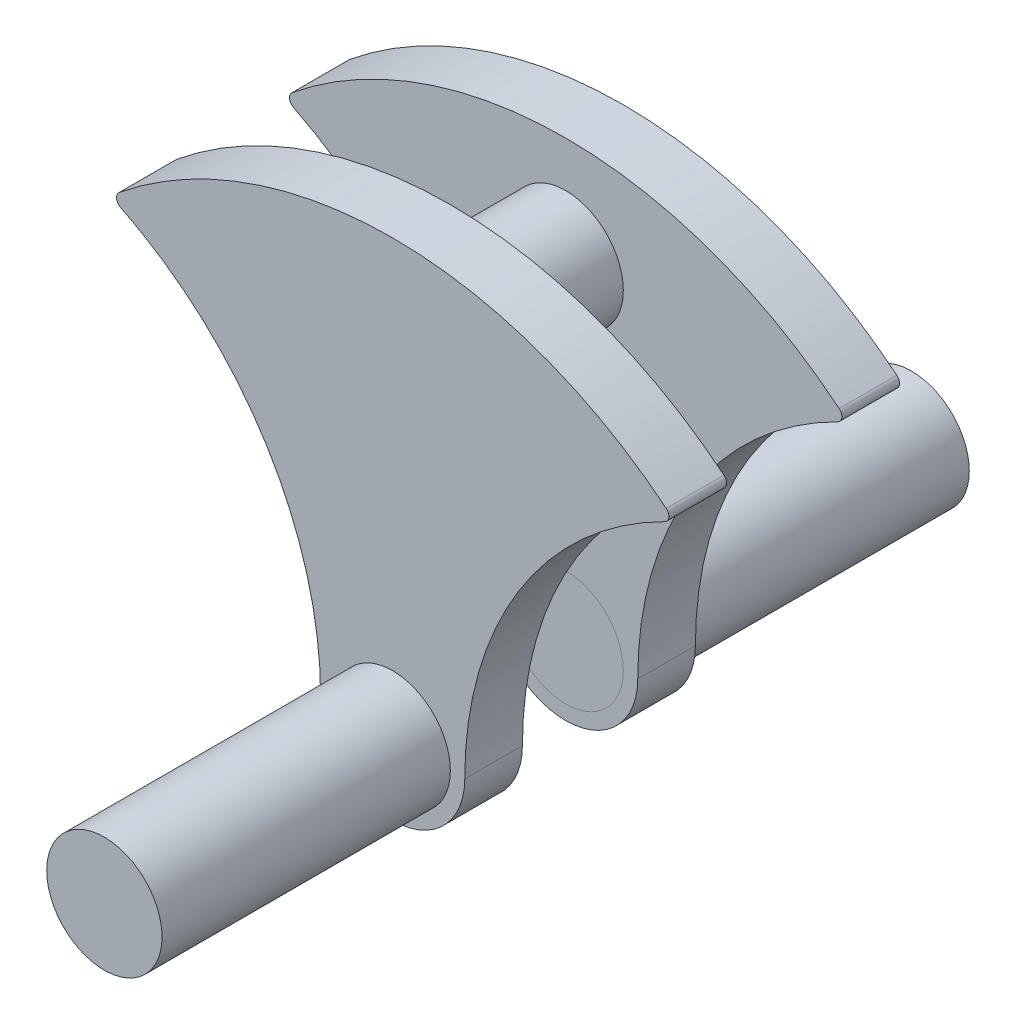
ISO-10303-21;
HEADER;
FILE_DESCRIPTION(('STEP AP214'),'2;1');
FILE_NAME('part.step','',(''),(''),'','','');
FILE_SCHEMA(('AUTOMOTIVE_DESIGN { 1 0 10303 214 1 1 1 1 }'));
ENDSEC;
DATA;
#1=APPLICATION_CONTEXT('core data for automotive mechanical design processes');
#2=APPLICATION_PROTOCOL_DEFINITION('international standard','automotive_design',2000,#1);
#3=PRODUCT_CONTEXT('',#1,'mechanical');
#4=PRODUCT('Part','Part','',(#3));
#5=PRODUCT_RELATED_PRODUCT_CATEGORY('part','',(#4));
#6=PRODUCT_DEFINITION_FORMATION('','',#4);
#7=PRODUCT_DEFINITION_CONTEXT('part definition',#1,'design');
#8=PRODUCT_DEFINITION('design','',#6,#7);
#9=PRODUCT_DEFINITION_SHAPE('','',#8);
#10=(LENGTH_UNIT() NAMED_UNIT(*) SI_UNIT(.MILLI.,.METRE.));
#11=(NAMED_UNIT(*) PLANE_ANGLE_UNIT() SI_UNIT($,.RADIAN.));
#12=(NAMED_UNIT(*) SI_UNIT($,.STERADIAN.) SOLID_ANGLE_UNIT());
#13=UNCERTAINTY_MEASURE_WITH_UNIT(LENGTH_MEASURE(1.E-05),#10,'distance_accuracy_value','');
#14=(GEOMETRIC_REPRESENTATION_CONTEXT(3) GLOBAL_UNCERTAINTY_ASSIGNED_CONTEXT((#13)) GLOBAL_UNIT_ASSIGNED_CONTEXT((#10,
#11,#12)) REPRESENTATION_CONTEXT('',''));
#15=CARTESIAN_POINT('',(0.,0.,0.));
#16=DIRECTION('',(0.,0.,1.));
#17=DIRECTION('',(1.,0.,0.));
#18=AXIS2_PLACEMENT_3D('',#15,#16,#17);
#19=CARTESIAN_POINT('',(0.,0.,20.));
#20=DIRECTION('',(0.,0.,-1.));
#21=DIRECTION('',(-1.,0.,0.));
#22=AXIS2_PLACEMENT_3D('',#19,#20,#21);
#23=CYLINDRICAL_SURFACE('',#22,20.);
#24=CARTESIAN_POINT('',(0.,0.,20.));
#25=DIRECTION('',(0.,0.,1.));
#26=DIRECTION('',(1.,0.,0.));
#27=AXIS2_PLACEMENT_3D('',#24,#25,#26);
#28=CIRCLE('',#27,20.);
#29=CARTESIAN_POINT('',(20.,0.,20.));
#30=VERTEX_POINT('',#29);
#31=EDGE_CURVE('E11',#30,#30,#28,.T.);
#32=ORIENTED_EDGE('',*,*,#31,.F.);
#33=EDGE_LOOP('',(#32));
#34=FACE_BOUND('',#33,.T.);
#35=CARTESIAN_POINT('',(0.,0.,-100.));
#36=DIRECTION('',(0.,0.,1.));
#37=DIRECTION('',(1.,0.,0.));
#38=AXIS2_PLACEMENT_3D('',#35,#36,#37);
#39=CIRCLE('',#38,20.);
#40=CARTESIAN_POINT('',(20.,0.,-100.));
#41=VERTEX_POINT('',#40);
#42=EDGE_CURVE('E55',#41,#41,#39,.T.);
#43=ORIENTED_EDGE('',*,*,#42,.T.);
#44=EDGE_LOOP('',(#43));
#45=FACE_BOUND('',#44,.T.);
#46=ADVANCED_FACE('F49',(#34,#45),#23,.T.);
#47=CARTESIAN_POINT('',(0.,0.,20.));
#48=DIRECTION('',(0.,0.,1.));
#49=DIRECTION('',(1.,0.,0.));
#50=AXIS2_PLACEMENT_3D('',#47,#48,#49);
#51=PLANE('',#50);
#52=ORIENTED_EDGE('',*,*,#31,.T.);
#53=EDGE_LOOP('',(#52));
#54=FACE_BOUND('',#53,.T.);
#55=ADVANCED_FACE('F64',(#54),#51,.T.);
#56=CARTESIAN_POINT('',(0.,0.,-100.));
#57=DIRECTION('',(0.,0.,1.));
#58=DIRECTION('',(1.,0.,0.));
#59=AXIS2_PLACEMENT_3D('',#56,#57,#58);
#60=PLANE('',#59);
#61=ORIENTED_EDGE('',*,*,#42,.F.);
#62=EDGE_LOOP('',(#61));
#63=FACE_BOUND('',#62,.T.);
#64=ADVANCED_FACE('F62',(#63),#60,.F.);
#65=CLOSED_SHELL('',(#46,#55,#64));
#66=MANIFOLD_SOLID_BREP('B2',#65);
#67=CARTESIAN_POINT('',(75.,0.,20.));
#68=DIRECTION('',(0.,0.,1.));
#69=DIRECTION('',(1.,0.,0.));
#70=AXIS2_PLACEMENT_3D('',#67,#68,#69);
#71=PLANE('',#70);
#72=CARTESIAN_POINT('',(0.,0.,20.));
#73=DIRECTION('',(0.,0.,1.));
#74=DIRECTION('',(1.,0.,0.));
#75=AXIS2_PLACEMENT_3D('',#72,#73,#74);
#76=CIRCLE('',#75,20.);
#77=CARTESIAN_POINT('',(20.,0.,20.));
#78=VERTEX_POINT('',#77);
#79=EDGE_CURVE('E191',#78,#78,#76,.T.);
#80=ORIENTED_EDGE('',*,*,#79,.F.);
#81=EDGE_LOOP('',(#80));
#82=FACE_BOUND('',#81,.T.);
#83=CARTESIAN_POINT('',(150.,0.,20.));
#84=DIRECTION('',(0.,0.,-1.));
#85=DIRECTION('',(1.,0.,0.));
#86=AXIS2_PLACEMENT_3D('',#83,#84,#85);
#87=CIRCLE('',#86,125.);
#88=CARTESIAN_POINT('',(25.,0.,20.));
#89=VERTEX_POINT('',#88);
#90=CARTESIAN_POINT('',(94.3899952955936,111.948771216016,20.));
#91=VERTEX_POINT('',#90);
#92=EDGE_CURVE('E198',#89,#91,#87,.T.);
#93=ORIENTED_EDGE('',*,*,#92,.T.);
#94=CARTESIAN_POINT('',(93.26,114.223570247125,20.));
#95=DIRECTION('',(0.,0.,1.));
#96=DIRECTION('',(1.,0.,0.));
#97=AXIS2_PLACEMENT_3D('',#94,#95,#96);
#98=CIRCLE('',#97,2.53999999999998);
#99=CARTESIAN_POINT('',(94.866404448664,116.191072406543,20.));
#100=VERTEX_POINT('',#99);
#101=EDGE_CURVE('E153',#91,#100,#98,.T.);
#102=ORIENTED_EDGE('',*,*,#101,.T.);
#103=CARTESIAN_POINT('',(0.,0.,20.));
#104=DIRECTION('',(0.,0.,1.));
#105=DIRECTION('',(1.,0.,0.));
#106=AXIS2_PLACEMENT_3D('',#103,#104,#105);
#107=CIRCLE('',#106,150.);
#108=CARTESIAN_POINT('',(-94.866404448664,116.191072406543,20.));
#109=VERTEX_POINT('',#108);
#110=EDGE_CURVE('E169',#100,#109,#107,.T.);
#111=ORIENTED_EDGE('',*,*,#110,.T.);
#112=CARTESIAN_POINT('',(-93.26,114.223570247125,20.));
#113=DIRECTION('',(0.,0.,1.));
#114=DIRECTION('',(-1.,0.,0.));
#115=AXIS2_PLACEMENT_3D('',#112,#113,#114);
#116=CIRCLE('',#115,2.53999999999997);
#117=CARTESIAN_POINT('',(-94.3899952955935,111.948771216016,20.));
#118=VERTEX_POINT('',#117);
#119=EDGE_CURVE('E163',#109,#118,#116,.T.);
#120=ORIENTED_EDGE('',*,*,#119,.T.);
#121=CARTESIAN_POINT('',(-150.,0.,20.));
#122=DIRECTION('',(0.,0.,-1.));
#123=DIRECTION('',(1.,0.,0.));
#124=AXIS2_PLACEMENT_3D('',#121,#122,#123);
#125=CIRCLE('',#124,125.);
#126=CARTESIAN_POINT('',(-25.,0.,20.));
#127=VERTEX_POINT('',#126);
#128=EDGE_CURVE('E167',#118,#127,#125,.T.);
#129=ORIENTED_EDGE('',*,*,#128,.T.);
#130=CARTESIAN_POINT('',(0.,0.,20.));
#131=DIRECTION('',(0.,0.,1.));
#132=DIRECTION('',(1.,0.,0.));
#133=AXIS2_PLACEMENT_3D('',#130,#131,#132);
#134=CIRCLE('',#133,25.);
#135=EDGE_CURVE('E115',#127,#89,#134,.T.);
#136=ORIENTED_EDGE('',*,*,#135,.T.);
#137=EDGE_LOOP('',(#93,#102,#111,#120,#129,#136));
#138=FACE_BOUND('',#137,.T.);
#139=CARTESIAN_POINT('',(0.,114.223570247125,20.));
#140=DIRECTION('',(0.,0.,1.));
#141=DIRECTION('',(1.,0.,0.));
#142=AXIS2_PLACEMENT_3D('',#139,#140,#141);
#143=CIRCLE('',#142,20.);
#144=CARTESIAN_POINT('',(20.,114.223570247125,20.));
#145=VERTEX_POINT('',#144);
#146=EDGE_CURVE('E343',#145,#145,#143,.T.);
#147=ORIENTED_EDGE('',*,*,#146,.F.);
#148=EDGE_LOOP('',(#147));
#149=FACE_BOUND('',#148,.T.);
#150=ADVANCED_FACE('F98',(#82,#138,#149),#71,.T.);
#151=CARTESIAN_POINT('',(75.,0.,0.));
#152=DIRECTION('',(0.,0.,1.));
#153=DIRECTION('',(1.,0.,0.));
#154=AXIS2_PLACEMENT_3D('',#151,#152,#153);
#155=PLANE('',#154);
#156=CARTESIAN_POINT('',(0.,0.,0.));
#157=DIRECTION('',(0.,0.,1.));
#158=DIRECTION('',(1.,0.,0.));
#159=AXIS2_PLACEMENT_3D('',#156,#157,#158);
#160=CIRCLE('',#159,20.);
#161=CARTESIAN_POINT('',(20.,0.,0.));
#162=VERTEX_POINT('',#161);
#163=EDGE_CURVE('E346',#162,#162,#160,.T.);
#164=ORIENTED_EDGE('',*,*,#163,.T.);
#165=EDGE_LOOP('',(#164));
#166=FACE_BOUND('',#165,.T.);
#167=CARTESIAN_POINT('',(150.,0.,0.));
#168=DIRECTION('',(0.,0.,-1.));
#169=DIRECTION('',(1.,0.,0.));
#170=AXIS2_PLACEMENT_3D('',#167,#168,#169);
#171=CIRCLE('',#170,125.);
#172=CARTESIAN_POINT('',(25.,0.,0.));
#173=VERTEX_POINT('',#172);
#174=CARTESIAN_POINT('',(94.3899952955936,111.948771216016,0.));
#175=VERTEX_POINT('',#174);
#176=EDGE_CURVE('E187',#173,#175,#171,.T.);
#177=ORIENTED_EDGE('',*,*,#176,.F.);
#178=CARTESIAN_POINT('',(0.,0.,0.));
#179=DIRECTION('',(0.,0.,1.));
#180=DIRECTION('',(1.,0.,0.));
#181=AXIS2_PLACEMENT_3D('',#178,#179,#180);
#182=CIRCLE('',#181,25.);
#183=CARTESIAN_POINT('',(-25.,0.,0.));
#184=VERTEX_POINT('',#183);
#185=EDGE_CURVE('E145',#184,#173,#182,.T.);
#186=ORIENTED_EDGE('',*,*,#185,.F.);
#187=CARTESIAN_POINT('',(-150.,0.,0.));
#188=DIRECTION('',(0.,0.,-1.));
#189=DIRECTION('',(1.,0.,0.));
#190=AXIS2_PLACEMENT_3D('',#187,#188,#189);
#191=CIRCLE('',#190,125.);
#192=CARTESIAN_POINT('',(-94.3899952955935,111.948771216016,0.));
#193=VERTEX_POINT('',#192);
#194=EDGE_CURVE('E139',#193,#184,#191,.T.);
#195=ORIENTED_EDGE('',*,*,#194,.F.);
#196=CARTESIAN_POINT('',(-93.26,114.223570247125,0.));
#197=DIRECTION('',(0.,0.,1.));
#198=DIRECTION('',(-1.,0.,0.));
#199=AXIS2_PLACEMENT_3D('',#196,#197,#198);
#200=CIRCLE('',#199,2.53999999999997);
#201=CARTESIAN_POINT('',(-94.866404448664,116.191072406543,0.));
#202=VERTEX_POINT('',#201);
#203=EDGE_CURVE('E177',#202,#193,#200,.T.);
#204=ORIENTED_EDGE('',*,*,#203,.F.);
#205=CARTESIAN_POINT('',(0.,0.,0.));
#206=DIRECTION('',(0.,0.,1.));
#207=DIRECTION('',(1.,0.,0.));
#208=AXIS2_PLACEMENT_3D('',#205,#206,#207);
#209=CIRCLE('',#208,150.);
#210=CARTESIAN_POINT('',(94.866404448664,116.191072406543,0.));
#211=VERTEX_POINT('',#210);
#212=EDGE_CURVE('E193',#211,#202,#209,.T.);
#213=ORIENTED_EDGE('',*,*,#212,.F.);
#214=CARTESIAN_POINT('',(93.26,114.223570247125,0.));
#215=DIRECTION('',(0.,0.,1.));
#216=DIRECTION('',(1.,0.,0.));
#217=AXIS2_PLACEMENT_3D('',#214,#215,#216);
#218=CIRCLE('',#217,2.53999999999998);
#219=EDGE_CURVE('E190',#175,#211,#218,.T.);
#220=ORIENTED_EDGE('',*,*,#219,.F.);
#221=EDGE_LOOP('',(#177,#186,#195,#204,#213,#220));
#222=FACE_BOUND('',#221,.T.);
#223=ADVANCED_FACE('F207',(#166,#222),#155,.F.);
#224=CARTESIAN_POINT('',(150.,0.,20.));
#225=DIRECTION('',(0.,0.,-1.));
#226=DIRECTION('',(-1.,0.,0.));
#227=AXIS2_PLACEMENT_3D('',#224,#225,#226);
#228=CYLINDRICAL_SURFACE('',#227,125.);
#229=ORIENTED_EDGE('',*,*,#176,.T.);
#230=DIRECTION('',(0.,0.,-1.));
#231=VECTOR('',#230,1.);
#232=CARTESIAN_POINT('',(94.3899952955936,111.948771216016,20.));
#233=LINE('',#232,#231);
#234=EDGE_CURVE('E47',#91,#175,#233,.T.);
#235=ORIENTED_EDGE('',*,*,#234,.F.);
#236=ORIENTED_EDGE('',*,*,#92,.F.);
#237=DIRECTION('',(0.,0.,-1.));
#238=VECTOR('',#237,1.);
#239=CARTESIAN_POINT('',(25.,0.,20.));
#240=LINE('',#239,#238);
#241=EDGE_CURVE('E183',#89,#173,#240,.T.);
#242=ORIENTED_EDGE('',*,*,#241,.T.);
#243=EDGE_LOOP('',(#229,#235,#236,#242));
#244=FACE_BOUND('',#243,.T.);
#245=ADVANCED_FACE('F100',(#244),#228,.F.);
#246=CARTESIAN_POINT('',(93.26,114.223570247125,20.));
#247=DIRECTION('',(0.,0.,-1.));
#248=DIRECTION('',(-1.,0.,0.));
#249=AXIS2_PLACEMENT_3D('',#246,#247,#248);
#250=CYLINDRICAL_SURFACE('',#249,2.53999999999998);
#251=ORIENTED_EDGE('',*,*,#219,.T.);
#252=DIRECTION('',(0.,0.,-1.));
#253=VECTOR('',#252,1.);
#254=CARTESIAN_POINT('',(94.866404448664,116.191072406543,20.));
#255=LINE('',#254,#253);
#256=EDGE_CURVE('E107',#100,#211,#255,.T.);
#257=ORIENTED_EDGE('',*,*,#256,.F.);
#258=ORIENTED_EDGE('',*,*,#101,.F.);
#259=ORIENTED_EDGE('',*,*,#234,.T.);
#260=EDGE_LOOP('',(#251,#257,#258,#259));
#261=FACE_BOUND('',#260,.T.);
#262=ADVANCED_FACE('F467',(#261),#250,.T.);
#263=CARTESIAN_POINT('',(0.,0.,20.));
#264=DIRECTION('',(0.,0.,-1.));
#265=DIRECTION('',(-1.,0.,0.));
#266=AXIS2_PLACEMENT_3D('',#263,#264,#265);
#267=CYLINDRICAL_SURFACE('',#266,150.);
#268=ORIENTED_EDGE('',*,*,#212,.T.);
#269=DIRECTION('',(0.,0.,-1.));
#270=VECTOR('',#269,1.);
#271=CARTESIAN_POINT('',(-94.866404448664,116.191072406543,20.));
#272=LINE('',#271,#270);
#273=EDGE_CURVE('E178',#109,#202,#272,.T.);
#274=ORIENTED_EDGE('',*,*,#273,.F.);
#275=ORIENTED_EDGE('',*,*,#110,.F.);
#276=ORIENTED_EDGE('',*,*,#256,.T.);
#277=EDGE_LOOP('',(#268,#274,#275,#276));
#278=FACE_BOUND('',#277,.T.);
#279=ADVANCED_FACE('F204',(#278),#267,.T.);
#280=CARTESIAN_POINT('',(-93.26,114.223570247125,20.));
#281=DIRECTION('',(0.,0.,-1.));
#282=DIRECTION('',(-1.,0.,0.));
#283=AXIS2_PLACEMENT_3D('',#280,#281,#282);
#284=CYLINDRICAL_SURFACE('',#283,2.53999999999997);
#285=ORIENTED_EDGE('',*,*,#203,.T.);
#286=DIRECTION('',(0.,0.,-1.));
#287=VECTOR('',#286,1.);
#288=CARTESIAN_POINT('',(-94.3899952955935,111.948771216016,20.));
#289=LINE('',#288,#287);
#290=EDGE_CURVE('E174',#118,#193,#289,.T.);
#291=ORIENTED_EDGE('',*,*,#290,.F.);
#292=ORIENTED_EDGE('',*,*,#119,.F.);
#293=ORIENTED_EDGE('',*,*,#273,.T.);
#294=EDGE_LOOP('',(#285,#291,#292,#293));
#295=FACE_BOUND('',#294,.T.);
#296=ADVANCED_FACE('F175',(#295),#284,.T.);
#297=CARTESIAN_POINT('',(-150.,0.,20.));
#298=DIRECTION('',(0.,0.,-1.));
#299=DIRECTION('',(-1.,0.,0.));
#300=AXIS2_PLACEMENT_3D('',#297,#298,#299);
#301=CYLINDRICAL_SURFACE('',#300,125.);
#302=ORIENTED_EDGE('',*,*,#194,.T.);
#303=DIRECTION('',(0.,0.,-1.));
#304=VECTOR('',#303,1.);
#305=CARTESIAN_POINT('',(-25.,0.,20.));
#306=LINE('',#305,#304);
#307=EDGE_CURVE('E179',#127,#184,#306,.T.);
#308=ORIENTED_EDGE('',*,*,#307,.F.);
#309=ORIENTED_EDGE('',*,*,#128,.F.);
#310=ORIENTED_EDGE('',*,*,#290,.T.);
#311=EDGE_LOOP('',(#302,#308,#309,#310));
#312=FACE_BOUND('',#311,.T.);
#313=ADVANCED_FACE('F181',(#312),#301,.F.);
#314=CARTESIAN_POINT('',(0.,0.,20.));
#315=DIRECTION('',(0.,0.,-1.));
#316=DIRECTION('',(-1.,0.,0.));
#317=AXIS2_PLACEMENT_3D('',#314,#315,#316);
#318=CYLINDRICAL_SURFACE('',#317,25.);
#319=ORIENTED_EDGE('',*,*,#185,.T.);
#320=ORIENTED_EDGE('',*,*,#241,.F.);
#321=ORIENTED_EDGE('',*,*,#135,.F.);
#322=ORIENTED_EDGE('',*,*,#307,.T.);
#323=EDGE_LOOP('',(#319,#320,#321,#322));
#324=FACE_BOUND('',#323,.T.);
#325=ADVANCED_FACE('F211',(#324),#318,.T.);
#326=CARTESIAN_POINT('',(0.,0.,20.));
#327=DIRECTION('',(0.,0.,-1.));
#328=DIRECTION('',(-1.,0.,0.));
#329=AXIS2_PLACEMENT_3D('',#326,#327,#328);
#330=CYLINDRICAL_SURFACE('',#329,20.);
#331=ORIENTED_EDGE('',*,*,#79,.T.);
#332=EDGE_LOOP('',(#331));
#333=FACE_BOUND('',#332,.T.);
#334=ORIENTED_EDGE('',*,*,#163,.F.);
#335=EDGE_LOOP('',(#334));
#336=FACE_BOUND('',#335,.T.);
#337=ADVANCED_FACE('F213',(#333,#336),#330,.F.);
#338=CARTESIAN_POINT('',(0.,114.223570247125,80.));
#339=DIRECTION('',(0.,0.,-1.));
#340=DIRECTION('',(-1.,0.,0.));
#341=AXIS2_PLACEMENT_3D('',#338,#339,#340);
#342=CYLINDRICAL_SURFACE('',#341,20.);
#343=CARTESIAN_POINT('',(0.,114.223570247125,60.));
#344=DIRECTION('',(0.,0.,1.));
#345=DIRECTION('',(1.,0.,0.));
#346=AXIS2_PLACEMENT_3D('',#343,#344,#345);
#347=CIRCLE('',#346,20.);
#348=CARTESIAN_POINT('',(20.,114.223570247125,60.));
#349=VERTEX_POINT('',#348);
#350=EDGE_CURVE('E281',#349,#349,#347,.T.);
#351=ORIENTED_EDGE('',*,*,#350,.F.);
#352=EDGE_LOOP('',(#351));
#353=FACE_BOUND('',#352,.T.);
#354=ORIENTED_EDGE('',*,*,#146,.T.);
#355=EDGE_LOOP('',(#354));
#356=FACE_BOUND('',#355,.T.);
#357=ADVANCED_FACE('F219',(#353,#356),#342,.T.);
#358=CARTESIAN_POINT('',(150.,0.,60.));
#359=DIRECTION('',(0.,0.,1.));
#360=DIRECTION('',(1.,0.,0.));
#361=AXIS2_PLACEMENT_3D('',#358,#359,#360);
#362=CYLINDRICAL_SURFACE('',#361,125.);
#363=CARTESIAN_POINT('',(150.,0.,80.));
#364=DIRECTION('',(0.,0.,-1.));
#365=DIRECTION('',(1.,0.,0.));
#366=AXIS2_PLACEMENT_3D('',#363,#364,#365);
#367=CIRCLE('',#366,125.);
#368=CARTESIAN_POINT('',(25.,0.,80.));
#369=VERTEX_POINT('',#368);
#370=CARTESIAN_POINT('',(94.3899952955936,111.948771216016,80.));
#371=VERTEX_POINT('',#370);
#372=EDGE_CURVE('E289',#369,#371,#367,.T.);
#373=ORIENTED_EDGE('',*,*,#372,.F.);
#374=DIRECTION('',(0.,0.,1.));
#375=VECTOR('',#374,1.);
#376=CARTESIAN_POINT('',(25.,0.,60.));
#377=LINE('',#376,#375);
#378=CARTESIAN_POINT('',(25.,0.,60.));
#379=VERTEX_POINT('',#378);
#380=EDGE_CURVE('E340',#379,#369,#377,.T.);
#381=ORIENTED_EDGE('',*,*,#380,.F.);
#382=CARTESIAN_POINT('',(150.,0.,60.));
#383=DIRECTION('',(0.,0.,-1.));
#384=DIRECTION('',(1.,0.,0.));
#385=AXIS2_PLACEMENT_3D('',#382,#383,#384);
#386=CIRCLE('',#385,125.);
#387=CARTESIAN_POINT('',(94.3899952955936,111.948771216016,60.));
#388=VERTEX_POINT('',#387);
#389=EDGE_CURVE('E290',#379,#388,#386,.T.);
#390=ORIENTED_EDGE('',*,*,#389,.T.);
#391=DIRECTION('',(0.,0.,1.));
#392=VECTOR('',#391,1.);
#393=CARTESIAN_POINT('',(94.3899952955936,111.948771216016,60.));
#394=LINE('',#393,#392);
#395=EDGE_CURVE('E309',#388,#371,#394,.T.);
#396=ORIENTED_EDGE('',*,*,#395,.T.);
#397=EDGE_LOOP('',(#373,#381,#390,#396));
#398=FACE_BOUND('',#397,.T.);
#399=ADVANCED_FACE('F235',(#398),#362,.F.);
#400=CARTESIAN_POINT('',(0.,0.,60.));
#401=DIRECTION('',(0.,0.,1.));
#402=DIRECTION('',(1.,0.,0.));
#403=AXIS2_PLACEMENT_3D('',#400,#401,#402);
#404=CYLINDRICAL_SURFACE('',#403,25.);
#405=CARTESIAN_POINT('',(0.,0.,80.));
#406=DIRECTION('',(0.,0.,1.));
#407=DIRECTION('',(1.,0.,0.));
#408=AXIS2_PLACEMENT_3D('',#405,#406,#407);
#409=CIRCLE('',#408,25.);
#410=CARTESIAN_POINT('',(-25.,0.,80.));
#411=VERTEX_POINT('',#410);
#412=EDGE_CURVE('E312',#411,#369,#409,.T.);
#413=ORIENTED_EDGE('',*,*,#412,.F.);
#414=DIRECTION('',(0.,0.,1.));
#415=VECTOR('',#414,1.);
#416=CARTESIAN_POINT('',(-25.,0.,60.));
#417=LINE('',#416,#415);
#418=CARTESIAN_POINT('',(-25.,0.,60.));
#419=VERTEX_POINT('',#418);
#420=EDGE_CURVE('E337',#419,#411,#417,.T.);
#421=ORIENTED_EDGE('',*,*,#420,.F.);
#422=CARTESIAN_POINT('',(0.,0.,60.));
#423=DIRECTION('',(0.,0.,1.));
#424=DIRECTION('',(1.,0.,0.));
#425=AXIS2_PLACEMENT_3D('',#422,#423,#424);
#426=CIRCLE('',#425,25.);
#427=EDGE_CURVE('E293',#419,#379,#426,.T.);
#428=ORIENTED_EDGE('',*,*,#427,.T.);
#429=ORIENTED_EDGE('',*,*,#380,.T.);
#430=EDGE_LOOP('',(#413,#421,#428,#429));
#431=FACE_BOUND('',#430,.T.);
#432=ADVANCED_FACE('F245',(#431),#404,.T.);
#433=CARTESIAN_POINT('',(-150.,0.,60.));
#434=DIRECTION('',(0.,0.,1.));
#435=DIRECTION('',(1.,0.,0.));
#436=AXIS2_PLACEMENT_3D('',#433,#434,#435);
#437=CYLINDRICAL_SURFACE('',#436,125.);
#438=CARTESIAN_POINT('',(-150.,0.,80.));
#439=DIRECTION('',(0.,0.,-1.));
#440=DIRECTION('',(1.,0.,0.));
#441=AXIS2_PLACEMENT_3D('',#438,#439,#440);
#442=CIRCLE('',#441,125.);
#443=CARTESIAN_POINT('',(-94.3899952955935,111.948771216016,80.));
#444=VERTEX_POINT('',#443);
#445=EDGE_CURVE('E315',#444,#411,#442,.T.);
#446=ORIENTED_EDGE('',*,*,#445,.F.);
#447=DIRECTION('',(0.,0.,1.));
#448=VECTOR('',#447,1.);
#449=CARTESIAN_POINT('',(-94.3899952955935,111.948771216016,60.));
#450=LINE('',#449,#448);
#451=CARTESIAN_POINT('',(-94.3899952955935,111.948771216016,60.));
#452=VERTEX_POINT('',#451);
#453=EDGE_CURVE('E334',#452,#444,#450,.T.);
#454=ORIENTED_EDGE('',*,*,#453,.F.);
#455=CARTESIAN_POINT('',(-150.,0.,60.));
#456=DIRECTION('',(0.,0.,-1.));
#457=DIRECTION('',(1.,0.,0.));
#458=AXIS2_PLACEMENT_3D('',#455,#456,#457);
#459=CIRCLE('',#458,125.);
#460=EDGE_CURVE('E297',#452,#419,#459,.T.);
#461=ORIENTED_EDGE('',*,*,#460,.T.);
#462=ORIENTED_EDGE('',*,*,#420,.T.);
#463=EDGE_LOOP('',(#446,#454,#461,#462));
#464=FACE_BOUND('',#463,.T.);
#465=ADVANCED_FACE('F249',(#464),#437,.F.);
#466=CARTESIAN_POINT('',(-93.26,114.223570247125,60.));
#467=DIRECTION('',(0.,0.,1.));
#468=DIRECTION('',(1.,0.,0.));
#469=AXIS2_PLACEMENT_3D('',#466,#467,#468);
#470=CYLINDRICAL_SURFACE('',#469,2.53999999999997);
#471=CARTESIAN_POINT('',(-93.26,114.223570247125,80.));
#472=DIRECTION('',(0.,0.,1.));
#473=DIRECTION('',(-1.,0.,0.));
#474=AXIS2_PLACEMENT_3D('',#471,#472,#473);
#475=CIRCLE('',#474,2.53999999999997);
#476=CARTESIAN_POINT('',(-94.866404448664,116.191072406543,80.));
#477=VERTEX_POINT('',#476);
#478=EDGE_CURVE('E318',#477,#444,#475,.T.);
#479=ORIENTED_EDGE('',*,*,#478,.F.);
#480=DIRECTION('',(0.,0.,1.));
#481=VECTOR('',#480,1.);
#482=CARTESIAN_POINT('',(-94.866404448664,116.191072406543,60.));
#483=LINE('',#482,#481);
#484=CARTESIAN_POINT('',(-94.866404448664,116.191072406543,60.));
#485=VERTEX_POINT('',#484);
#486=EDGE_CURVE('E331',#485,#477,#483,.T.);
#487=ORIENTED_EDGE('',*,*,#486,.F.);
#488=CARTESIAN_POINT('',(-93.26,114.223570247125,60.));
#489=DIRECTION('',(0.,0.,1.));
#490=DIRECTION('',(-1.,0.,0.));
#491=AXIS2_PLACEMENT_3D('',#488,#489,#490);
#492=CIRCLE('',#491,2.53999999999997);
#493=EDGE_CURVE('E300',#485,#452,#492,.T.);
#494=ORIENTED_EDGE('',*,*,#493,.T.);
#495=ORIENTED_EDGE('',*,*,#453,.T.);
#496=EDGE_LOOP('',(#479,#487,#494,#495));
#497=FACE_BOUND('',#496,.T.);
#498=ADVANCED_FACE('F253',(#497),#470,.T.);
#499=CARTESIAN_POINT('',(0.,0.,60.));
#500=DIRECTION('',(0.,0.,1.));
#501=DIRECTION('',(1.,0.,0.));
#502=AXIS2_PLACEMENT_3D('',#499,#500,#501);
#503=CYLINDRICAL_SURFACE('',#502,150.);
#504=CARTESIAN_POINT('',(0.,0.,80.));
#505=DIRECTION('',(0.,0.,1.));
#506=DIRECTION('',(1.,0.,0.));
#507=AXIS2_PLACEMENT_3D('',#504,#505,#506);
#508=CIRCLE('',#507,150.);
#509=CARTESIAN_POINT('',(94.866404448664,116.191072406543,80.));
#510=VERTEX_POINT('',#509);
#511=EDGE_CURVE('E321',#510,#477,#508,.T.);
#512=ORIENTED_EDGE('',*,*,#511,.F.);
#513=DIRECTION('',(0.,0.,1.));
#514=VECTOR('',#513,1.);
#515=CARTESIAN_POINT('',(94.866404448664,116.191072406543,60.));
#516=LINE('',#515,#514);
#517=CARTESIAN_POINT('',(94.866404448664,116.191072406543,60.));
#518=VERTEX_POINT('',#517);
#519=EDGE_CURVE('E328',#518,#510,#516,.T.);
#520=ORIENTED_EDGE('',*,*,#519,.F.);
#521=CARTESIAN_POINT('',(0.,0.,60.));
#522=DIRECTION('',(0.,0.,1.));
#523=DIRECTION('',(1.,0.,0.));
#524=AXIS2_PLACEMENT_3D('',#521,#522,#523);
#525=CIRCLE('',#524,150.);
#526=EDGE_CURVE('E303',#518,#485,#525,.T.);
#527=ORIENTED_EDGE('',*,*,#526,.T.);
#528=ORIENTED_EDGE('',*,*,#486,.T.);
#529=EDGE_LOOP('',(#512,#520,#527,#528));
#530=FACE_BOUND('',#529,.T.);
#531=ADVANCED_FACE('F257',(#530),#503,.T.);
#532=CARTESIAN_POINT('',(93.26,114.223570247125,60.));
#533=DIRECTION('',(0.,0.,1.));
#534=DIRECTION('',(1.,0.,0.));
#535=AXIS2_PLACEMENT_3D('',#532,#533,#534);
#536=CYLINDRICAL_SURFACE('',#535,2.53999999999998);
#537=CARTESIAN_POINT('',(93.26,114.223570247125,80.));
#538=DIRECTION('',(0.,0.,1.));
#539=DIRECTION('',(1.,0.,0.));
#540=AXIS2_PLACEMENT_3D('',#537,#538,#539);
#541=CIRCLE('',#540,2.53999999999998);
#542=EDGE_CURVE('E294',#371,#510,#541,.T.);
#543=ORIENTED_EDGE('',*,*,#542,.F.);
#544=ORIENTED_EDGE('',*,*,#395,.F.);
#545=CARTESIAN_POINT('',(93.26,114.223570247125,60.));
#546=DIRECTION('',(0.,0.,1.));
#547=DIRECTION('',(1.,0.,0.));
#548=AXIS2_PLACEMENT_3D('',#545,#546,#547);
#549=CIRCLE('',#548,2.53999999999998);
#550=EDGE_CURVE('E306',#388,#518,#549,.T.);
#551=ORIENTED_EDGE('',*,*,#550,.T.);
#552=ORIENTED_EDGE('',*,*,#519,.T.);
#553=EDGE_LOOP('',(#543,#544,#551,#552));
#554=FACE_BOUND('',#553,.T.);
#555=ADVANCED_FACE('F261',(#554),#536,.T.);
#556=CARTESIAN_POINT('',(75.,0.,60.));
#557=DIRECTION('',(0.,0.,-1.));
#558=DIRECTION('',(1.,0.,0.));
#559=AXIS2_PLACEMENT_3D('',#556,#557,#558);
#560=PLANE('',#559);
#561=ORIENTED_EDGE('',*,*,#350,.T.);
#562=EDGE_LOOP('',(#561));
#563=FACE_BOUND('',#562,.T.);
#564=ORIENTED_EDGE('',*,*,#389,.F.);
#565=ORIENTED_EDGE('',*,*,#427,.F.);
#566=ORIENTED_EDGE('',*,*,#460,.F.);
#567=ORIENTED_EDGE('',*,*,#493,.F.);
#568=ORIENTED_EDGE('',*,*,#526,.F.);
#569=ORIENTED_EDGE('',*,*,#550,.F.);
#570=EDGE_LOOP('',(#564,#565,#566,#567,#568,#569));
#571=FACE_BOUND('',#570,.T.);
#572=ADVANCED_FACE('F241',(#563,#571),#560,.T.);
#573=CARTESIAN_POINT('',(0.,0.,80.));
#574=DIRECTION('',(0.,0.,1.));
#575=DIRECTION('',(1.,0.,0.));
#576=AXIS2_PLACEMENT_3D('',#573,#574,#575);
#577=PLANE('',#576);
#578=CARTESIAN_POINT('',(0.,0.,80.));
#579=DIRECTION('',(0.,0.,1.));
#580=DIRECTION('',(1.,0.,0.));
#581=AXIS2_PLACEMENT_3D('',#578,#579,#580);
#582=CIRCLE('',#581,20.);
#583=CARTESIAN_POINT('',(20.,0.,80.));
#584=VERTEX_POINT('',#583);
#585=EDGE_CURVE('E284',#584,#584,#582,.T.);
#586=ORIENTED_EDGE('',*,*,#585,.F.);
#587=EDGE_LOOP('',(#586));
#588=FACE_BOUND('',#587,.T.);
#589=ORIENTED_EDGE('',*,*,#372,.T.);
#590=ORIENTED_EDGE('',*,*,#542,.T.);
#591=ORIENTED_EDGE('',*,*,#511,.T.);
#592=ORIENTED_EDGE('',*,*,#478,.T.);
#593=ORIENTED_EDGE('',*,*,#445,.T.);
#594=ORIENTED_EDGE('',*,*,#412,.T.);
#595=EDGE_LOOP('',(#589,#590,#591,#592,#593,#594));
#596=FACE_BOUND('',#595,.T.);
#597=ADVANCED_FACE('F237',(#588,#596),#577,.T.);
#598=CARTESIAN_POINT('',(0.,0.,180.));
#599=DIRECTION('',(0.,0.,-1.));
#600=DIRECTION('',(-1.,0.,0.));
#601=AXIS2_PLACEMENT_3D('',#598,#599,#600);
#602=PLANE('',#601);
#603=CARTESIAN_POINT('',(0.,0.,180.));
#604=DIRECTION('',(0.,0.,-1.));
#605=DIRECTION('',(-1.,0.,0.));
#606=AXIS2_PLACEMENT_3D('',#603,#604,#605);
#607=CIRCLE('',#606,20.);
#608=CARTESIAN_POINT('',(-20.,0.,180.));
#609=VERTEX_POINT('',#608);
#610=EDGE_CURVE('E279',#609,#609,#607,.T.);
#611=ORIENTED_EDGE('',*,*,#610,.F.);
#612=EDGE_LOOP('',(#611));
#613=FACE_BOUND('',#612,.T.);
#614=ADVANCED_FACE('F240',(#613),#602,.F.);
#615=CARTESIAN_POINT('',(0.,0.,180.));
#616=DIRECTION('',(0.,0.,-1.));
#617=DIRECTION('',(-1.,0.,0.));
#618=AXIS2_PLACEMENT_3D('',#615,#616,#617);
#619=CYLINDRICAL_SURFACE('',#618,20.);
#620=ORIENTED_EDGE('',*,*,#585,.T.);
#621=EDGE_LOOP('',(#620));
#622=FACE_BOUND('',#621,.T.);
#623=ORIENTED_EDGE('',*,*,#610,.T.);
#624=EDGE_LOOP('',(#623));
#625=FACE_BOUND('',#624,.T.);
#626=ADVANCED_FACE('F269',(#622,#625),#619,.T.);
#627=CLOSED_SHELL('',(#150,#223,#245,#262,#279,#296,#313,#325,#337,#357,#399,#432,#465,#498,
#531,#555,#572,#597,#614,#626));
#628=MANIFOLD_SOLID_BREP('B6',#627);
#629=ADVANCED_BREP_SHAPE_REPRESENTATION('',(#18,#66,#628),#14);
#630=SHAPE_DEFINITION_REPRESENTATION(#9,#629);
ENDSEC;
END-ISO-10303-21;
